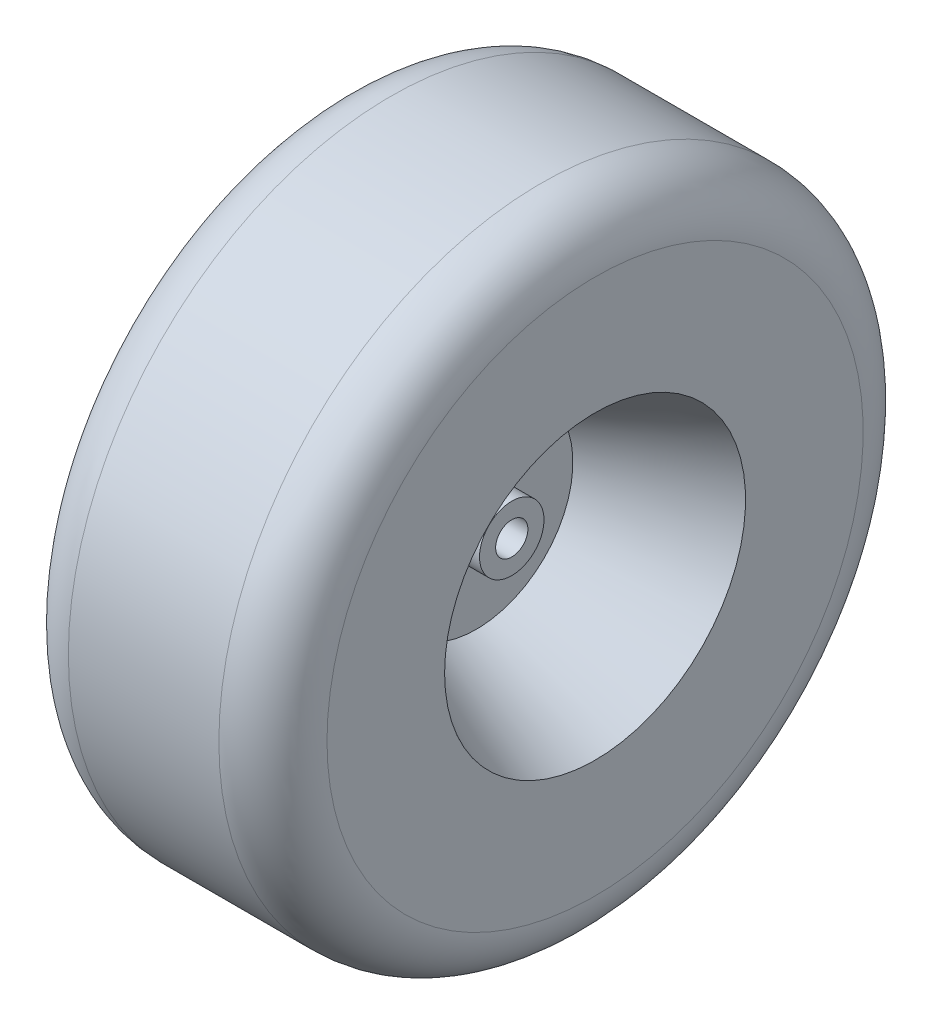
ISO-10303-21;
HEADER;
FILE_DESCRIPTION(('STEP AP214'),'2;1');
FILE_NAME('part.step','',(''),(''),'','','');
FILE_SCHEMA(('AUTOMOTIVE_DESIGN { 1 0 10303 214 1 1 1 1 }'));
ENDSEC;
DATA;
#1=APPLICATION_CONTEXT('core data for automotive mechanical design processes');
#2=APPLICATION_PROTOCOL_DEFINITION('international standard','automotive_design',2000,#1);
#3=PRODUCT_CONTEXT('',#1,'mechanical');
#4=PRODUCT('Part','Part','',(#3));
#5=PRODUCT_RELATED_PRODUCT_CATEGORY('part','',(#4));
#6=PRODUCT_DEFINITION_FORMATION('','',#4);
#7=PRODUCT_DEFINITION_CONTEXT('part definition',#1,'design');
#8=PRODUCT_DEFINITION('design','',#6,#7);
#9=PRODUCT_DEFINITION_SHAPE('','',#8);
#10=(LENGTH_UNIT() NAMED_UNIT(*) SI_UNIT(.MILLI.,.METRE.));
#11=(NAMED_UNIT(*) PLANE_ANGLE_UNIT() SI_UNIT($,.RADIAN.));
#12=(NAMED_UNIT(*) SI_UNIT($,.STERADIAN.) SOLID_ANGLE_UNIT());
#13=UNCERTAINTY_MEASURE_WITH_UNIT(LENGTH_MEASURE(1.E-05),#10,'distance_accuracy_value','');
#14=(GEOMETRIC_REPRESENTATION_CONTEXT(3) GLOBAL_UNCERTAINTY_ASSIGNED_CONTEXT((#13)) GLOBAL_UNIT_ASSIGNED_CONTEXT((#10,
#11,#12)) REPRESENTATION_CONTEXT('',''));
#15=CARTESIAN_POINT('',(0.,0.,0.));
#16=DIRECTION('',(0.,0.,1.));
#17=DIRECTION('',(1.,0.,0.));
#18=AXIS2_PLACEMENT_3D('',#15,#16,#17);
#19=CARTESIAN_POINT('',(76.2,88.9,0.));
#20=DIRECTION('',(-1.,0.,0.));
#21=DIRECTION('',(0.,0.,1.));
#22=AXIS2_PLACEMENT_3D('',#19,#20,#21);
#23=PLANE('',#22);
#24=CARTESIAN_POINT('',(76.2,0.,0.));
#25=DIRECTION('',(-1.,0.,0.));
#26=DIRECTION('',(0.,0.,1.));
#27=AXIS2_PLACEMENT_3D('',#24,#25,#26);
#28=CIRCLE('',#27,158.372961578439);
#29=CARTESIAN_POINT('',(76.2,0.,158.372961578439));
#30=VERTEX_POINT('',#29);
#31=EDGE_CURVE('E76',#30,#30,#28,.T.);
#32=ORIENTED_EDGE('',*,*,#31,.F.);
#33=EDGE_LOOP('',(#32));
#34=FACE_BOUND('',#33,.T.);
#35=CARTESIAN_POINT('',(76.2,0.,0.));
#36=DIRECTION('',(-1.,0.,0.));
#37=DIRECTION('',(0.,0.,1.));
#38=AXIS2_PLACEMENT_3D('',#35,#36,#37);
#39=CIRCLE('',#38,88.9);
#40=CARTESIAN_POINT('',(76.2,0.,88.9));
#41=VERTEX_POINT('',#40);
#42=EDGE_CURVE('E10',#41,#41,#39,.T.);
#43=ORIENTED_EDGE('',*,*,#42,.T.);
#44=EDGE_LOOP('',(#43));
#45=FACE_BOUND('',#44,.T.);
#46=ADVANCED_FACE('F30',(#34,#45),#23,.F.);
#47=CARTESIAN_POINT('',(6.11263969154835,0.,0.));
#48=DIRECTION('',(1.,0.,0.));
#49=DIRECTION('',(0.,0.,-1.));
#50=AXIS2_PLACEMENT_3D('',#47,#48,#49);
#51=CONICAL_SURFACE('',#50,56.9745874149852,0.427425630126478);
#52=ORIENTED_EDGE('',*,*,#42,.F.);
#53=EDGE_LOOP('',(#52));
#54=FACE_BOUND('',#53,.T.);
#55=CARTESIAN_POINT('',(6.11263969154835,0.,0.));
#56=DIRECTION('',(-1.,0.,0.));
#57=DIRECTION('',(0.,0.,1.));
#58=AXIS2_PLACEMENT_3D('',#55,#56,#57);
#59=CIRCLE('',#58,56.9745874149852);
#60=CARTESIAN_POINT('',(6.11263969154835,0.,56.9745874149852));
#61=VERTEX_POINT('',#60);
#62=EDGE_CURVE('E36',#61,#61,#59,.T.);
#63=ORIENTED_EDGE('',*,*,#62,.T.);
#64=EDGE_LOOP('',(#63));
#65=FACE_BOUND('',#64,.T.);
#66=ADVANCED_FACE('F83',(#54,#65),#51,.F.);
#67=CARTESIAN_POINT('',(6.11263969154835,19.05,0.));
#68=DIRECTION('',(-1.,0.,0.));
#69=DIRECTION('',(0.,0.,1.));
#70=AXIS2_PLACEMENT_3D('',#67,#68,#69);
#71=PLANE('',#70);
#72=ORIENTED_EDGE('',*,*,#62,.F.);
#73=EDGE_LOOP('',(#72));
#74=FACE_BOUND('',#73,.T.);
#75=CARTESIAN_POINT('',(6.11263969154835,0.,0.));
#76=DIRECTION('',(-1.,0.,0.));
#77=DIRECTION('',(0.,0.,1.));
#78=AXIS2_PLACEMENT_3D('',#75,#76,#77);
#79=CIRCLE('',#78,19.05);
#80=CARTESIAN_POINT('',(6.11263969154835,0.,19.05));
#81=VERTEX_POINT('',#80);
#82=EDGE_CURVE('E40',#81,#81,#79,.T.);
#83=ORIENTED_EDGE('',*,*,#82,.T.);
#84=EDGE_LOOP('',(#83));
#85=FACE_BOUND('',#84,.T.);
#86=ADVANCED_FACE('F87',(#74,#85),#71,.F.);
#87=CARTESIAN_POINT('',(-76.2,0.,0.));
#88=DIRECTION('',(-1.,0.,0.));
#89=DIRECTION('',(0.,0.,1.));
#90=AXIS2_PLACEMENT_3D('',#87,#88,#89);
#91=CYLINDRICAL_SURFACE('',#90,19.05);
#92=ORIENTED_EDGE('',*,*,#82,.F.);
#93=EDGE_LOOP('',(#92));
#94=FACE_BOUND('',#93,.T.);
#95=CARTESIAN_POINT('',(26.9875,0.,0.));
#96=DIRECTION('',(-1.,0.,0.));
#97=DIRECTION('',(0.,0.,1.));
#98=AXIS2_PLACEMENT_3D('',#95,#96,#97);
#99=CIRCLE('',#98,19.05);
#100=CARTESIAN_POINT('',(26.9875,0.,19.05));
#101=VERTEX_POINT('',#100);
#102=EDGE_CURVE('E44',#101,#101,#99,.T.);
#103=ORIENTED_EDGE('',*,*,#102,.T.);
#104=EDGE_LOOP('',(#103));
#105=FACE_BOUND('',#104,.T.);
#106=ADVANCED_FACE('F92',(#94,#105),#91,.T.);
#107=CARTESIAN_POINT('',(26.9875,9.52500000000001,0.));
#108=DIRECTION('',(-1.,0.,0.));
#109=DIRECTION('',(0.,0.,1.));
#110=AXIS2_PLACEMENT_3D('',#107,#108,#109);
#111=PLANE('',#110);
#112=ORIENTED_EDGE('',*,*,#102,.F.);
#113=EDGE_LOOP('',(#112));
#114=FACE_BOUND('',#113,.T.);
#115=CARTESIAN_POINT('',(26.9875,0.,0.));
#116=DIRECTION('',(-1.,0.,0.));
#117=DIRECTION('',(0.,0.,1.));
#118=AXIS2_PLACEMENT_3D('',#115,#116,#117);
#119=CIRCLE('',#118,9.52500000000001);
#120=CARTESIAN_POINT('',(26.9875,0.,9.52500000000001));
#121=VERTEX_POINT('',#120);
#122=EDGE_CURVE('E49',#121,#121,#119,.T.);
#123=ORIENTED_EDGE('',*,*,#122,.T.);
#124=EDGE_LOOP('',(#123));
#125=FACE_BOUND('',#124,.T.);
#126=ADVANCED_FACE('F98',(#114,#125),#111,.F.);
#127=CARTESIAN_POINT('',(-76.2,0.,0.));
#128=DIRECTION('',(-1.,0.,0.));
#129=DIRECTION('',(0.,0.,1.));
#130=AXIS2_PLACEMENT_3D('',#127,#128,#129);
#131=CYLINDRICAL_SURFACE('',#130,9.52500000000001);
#132=ORIENTED_EDGE('',*,*,#122,.F.);
#133=EDGE_LOOP('',(#132));
#134=FACE_BOUND('',#133,.T.);
#135=CARTESIAN_POINT('',(-26.9875,0.,0.));
#136=DIRECTION('',(-1.,0.,0.));
#137=DIRECTION('',(0.,0.,1.));
#138=AXIS2_PLACEMENT_3D('',#135,#136,#137);
#139=CIRCLE('',#138,9.52500000000001);
#140=CARTESIAN_POINT('',(-26.9875,0.,9.52500000000001));
#141=VERTEX_POINT('',#140);
#142=EDGE_CURVE('E52',#141,#141,#139,.T.);
#143=ORIENTED_EDGE('',*,*,#142,.T.);
#144=EDGE_LOOP('',(#143));
#145=FACE_BOUND('',#144,.T.);
#146=ADVANCED_FACE('F102',(#134,#145),#131,.F.);
#147=CARTESIAN_POINT('',(-26.9875,9.52500000000001,0.));
#148=DIRECTION('',(1.,0.,0.));
#149=DIRECTION('',(0.,0.,-1.));
#150=AXIS2_PLACEMENT_3D('',#147,#148,#149);
#151=PLANE('',#150);
#152=ORIENTED_EDGE('',*,*,#142,.F.);
#153=EDGE_LOOP('',(#152));
#154=FACE_BOUND('',#153,.T.);
#155=CARTESIAN_POINT('',(-26.9875,0.,0.));
#156=DIRECTION('',(-1.,0.,0.));
#157=DIRECTION('',(0.,0.,1.));
#158=AXIS2_PLACEMENT_3D('',#155,#156,#157);
#159=CIRCLE('',#158,19.05);
#160=CARTESIAN_POINT('',(-26.9875,0.,19.05));
#161=VERTEX_POINT('',#160);
#162=EDGE_CURVE('E55',#161,#161,#159,.T.);
#163=ORIENTED_EDGE('',*,*,#162,.T.);
#164=EDGE_LOOP('',(#163));
#165=FACE_BOUND('',#164,.T.);
#166=ADVANCED_FACE('F106',(#154,#165),#151,.F.);
#167=CARTESIAN_POINT('',(-76.2,0.,0.));
#168=DIRECTION('',(-1.,0.,0.));
#169=DIRECTION('',(0.,0.,1.));
#170=AXIS2_PLACEMENT_3D('',#167,#168,#169);
#171=CYLINDRICAL_SURFACE('',#170,19.05);
#172=ORIENTED_EDGE('',*,*,#162,.F.);
#173=EDGE_LOOP('',(#172));
#174=FACE_BOUND('',#173,.T.);
#175=CARTESIAN_POINT('',(-6.11263969154835,0.,0.));
#176=DIRECTION('',(-1.,0.,0.));
#177=DIRECTION('',(0.,0.,1.));
#178=AXIS2_PLACEMENT_3D('',#175,#176,#177);
#179=CIRCLE('',#178,19.05);
#180=CARTESIAN_POINT('',(-6.11263969154835,0.,19.05));
#181=VERTEX_POINT('',#180);
#182=EDGE_CURVE('E58',#181,#181,#179,.T.);
#183=ORIENTED_EDGE('',*,*,#182,.T.);
#184=EDGE_LOOP('',(#183));
#185=FACE_BOUND('',#184,.T.);
#186=ADVANCED_FACE('F110',(#174,#185),#171,.T.);
#187=CARTESIAN_POINT('',(-6.11263969154835,19.05,0.));
#188=DIRECTION('',(1.,0.,0.));
#189=DIRECTION('',(0.,0.,-1.));
#190=AXIS2_PLACEMENT_3D('',#187,#188,#189);
#191=PLANE('',#190);
#192=ORIENTED_EDGE('',*,*,#182,.F.);
#193=EDGE_LOOP('',(#192));
#194=FACE_BOUND('',#193,.T.);
#195=CARTESIAN_POINT('',(-6.11263969154835,0.,0.));
#196=DIRECTION('',(-1.,0.,0.));
#197=DIRECTION('',(0.,0.,1.));
#198=AXIS2_PLACEMENT_3D('',#195,#196,#197);
#199=CIRCLE('',#198,56.9745874149852);
#200=CARTESIAN_POINT('',(-6.11263969154835,0.,56.9745874149852));
#201=VERTEX_POINT('',#200);
#202=EDGE_CURVE('E61',#201,#201,#199,.T.);
#203=ORIENTED_EDGE('',*,*,#202,.T.);
#204=EDGE_LOOP('',(#203));
#205=FACE_BOUND('',#204,.T.);
#206=ADVANCED_FACE('F114',(#194,#205),#191,.F.);
#207=CARTESIAN_POINT('',(-76.2,0.,0.));
#208=DIRECTION('',(-1.,0.,0.));
#209=DIRECTION('',(0.,0.,1.));
#210=AXIS2_PLACEMENT_3D('',#207,#208,#209);
#211=CONICAL_SURFACE('',#210,88.9,0.427425630126478);
#212=ORIENTED_EDGE('',*,*,#202,.F.);
#213=EDGE_LOOP('',(#212));
#214=FACE_BOUND('',#213,.T.);
#215=CARTESIAN_POINT('',(-76.2,0.,0.));
#216=DIRECTION('',(-1.,0.,0.));
#217=DIRECTION('',(0.,0.,1.));
#218=AXIS2_PLACEMENT_3D('',#215,#216,#217);
#219=CIRCLE('',#218,88.9);
#220=CARTESIAN_POINT('',(-76.2,0.,88.9));
#221=VERTEX_POINT('',#220);
#222=EDGE_CURVE('E64',#221,#221,#219,.T.);
#223=ORIENTED_EDGE('',*,*,#222,.T.);
#224=EDGE_LOOP('',(#223));
#225=FACE_BOUND('',#224,.T.);
#226=ADVANCED_FACE('F118',(#214,#225),#211,.F.);
#227=CARTESIAN_POINT('',(-76.2,88.9,0.));
#228=DIRECTION('',(1.,0.,0.));
#229=DIRECTION('',(0.,0.,-1.));
#230=AXIS2_PLACEMENT_3D('',#227,#228,#229);
#231=PLANE('',#230);
#232=ORIENTED_EDGE('',*,*,#222,.F.);
#233=EDGE_LOOP('',(#232));
#234=FACE_BOUND('',#233,.T.);
#235=CARTESIAN_POINT('',(-76.2,0.,0.));
#236=DIRECTION('',(-1.,0.,0.));
#237=DIRECTION('',(0.,0.,1.));
#238=AXIS2_PLACEMENT_3D('',#235,#236,#237);
#239=CIRCLE('',#238,158.372961578439);
#240=CARTESIAN_POINT('',(-76.2,0.,158.372961578439));
#241=VERTEX_POINT('',#240);
#242=EDGE_CURVE('E67',#241,#241,#239,.T.);
#243=ORIENTED_EDGE('',*,*,#242,.T.);
#244=EDGE_LOOP('',(#243));
#245=FACE_BOUND('',#244,.T.);
#246=ADVANCED_FACE('F122',(#234,#245),#231,.F.);
#247=CARTESIAN_POINT('',(-44.0729616546245,0.,0.));
#248=DIRECTION('',(-1.,0.,0.));
#249=DIRECTION('',(0.,0.,1.));
#250=AXIS2_PLACEMENT_3D('',#247,#248,#249);
#251=TOROIDAL_SURFACE('',#250,158.375174088774,32.1270384215606);
#252=ORIENTED_EDGE('',*,*,#242,.F.);
#253=EDGE_LOOP('',(#252));
#254=FACE_BOUND('',#253,.T.);
#255=CARTESIAN_POINT('',(-44.45,0.,0.));
#256=DIRECTION('',(-1.,0.,0.));
#257=DIRECTION('',(0.,0.,1.));
#258=AXIS2_PLACEMENT_3D('',#255,#256,#257);
#259=CIRCLE('',#258,190.5);
#260=CARTESIAN_POINT('',(-44.45,0.,190.5));
#261=VERTEX_POINT('',#260);
#262=EDGE_CURVE('E70',#261,#261,#259,.T.);
#263=ORIENTED_EDGE('',*,*,#262,.T.);
#264=EDGE_LOOP('',(#263));
#265=FACE_BOUND('',#264,.T.);
#266=ADVANCED_FACE('F126',(#254,#265),#251,.T.);
#267=CARTESIAN_POINT('',(-76.2,0.,0.));
#268=DIRECTION('',(-1.,0.,0.));
#269=DIRECTION('',(0.,0.,1.));
#270=AXIS2_PLACEMENT_3D('',#267,#268,#269);
#271=CYLINDRICAL_SURFACE('',#270,190.5);
#272=ORIENTED_EDGE('',*,*,#262,.F.);
#273=EDGE_LOOP('',(#272));
#274=FACE_BOUND('',#273,.T.);
#275=CARTESIAN_POINT('',(44.45,0.,0.));
#276=DIRECTION('',(-1.,0.,0.));
#277=DIRECTION('',(0.,0.,1.));
#278=AXIS2_PLACEMENT_3D('',#275,#276,#277);
#279=CIRCLE('',#278,190.5);
#280=CARTESIAN_POINT('',(44.45,0.,190.5));
#281=VERTEX_POINT('',#280);
#282=EDGE_CURVE('E73',#281,#281,#279,.T.);
#283=ORIENTED_EDGE('',*,*,#282,.T.);
#284=EDGE_LOOP('',(#283));
#285=FACE_BOUND('',#284,.T.);
#286=ADVANCED_FACE('F130',(#274,#285),#271,.T.);
#287=CARTESIAN_POINT('',(44.0729616546245,0.,0.));
#288=DIRECTION('',(-1.,0.,0.));
#289=DIRECTION('',(0.,0.,1.));
#290=AXIS2_PLACEMENT_3D('',#287,#288,#289);
#291=TOROIDAL_SURFACE('',#290,158.375174088774,32.1270384215606);
#292=ORIENTED_EDGE('',*,*,#282,.F.);
#293=EDGE_LOOP('',(#292));
#294=FACE_BOUND('',#293,.T.);
#295=ORIENTED_EDGE('',*,*,#31,.T.);
#296=EDGE_LOOP('',(#295));
#297=FACE_BOUND('',#296,.T.);
#298=ADVANCED_FACE('F80',(#294,#297),#291,.T.);
#299=CLOSED_SHELL('',(#46,#66,#86,#106,#126,#146,#166,#186,#206,#226,#246,#266,#286,#298));
#300=MANIFOLD_SOLID_BREP('B2',#299);
#301=ADVANCED_BREP_SHAPE_REPRESENTATION('',(#18,#300),#14);
#302=SHAPE_DEFINITION_REPRESENTATION(#9,#301);
ENDSEC;
END-ISO-10303-21;
